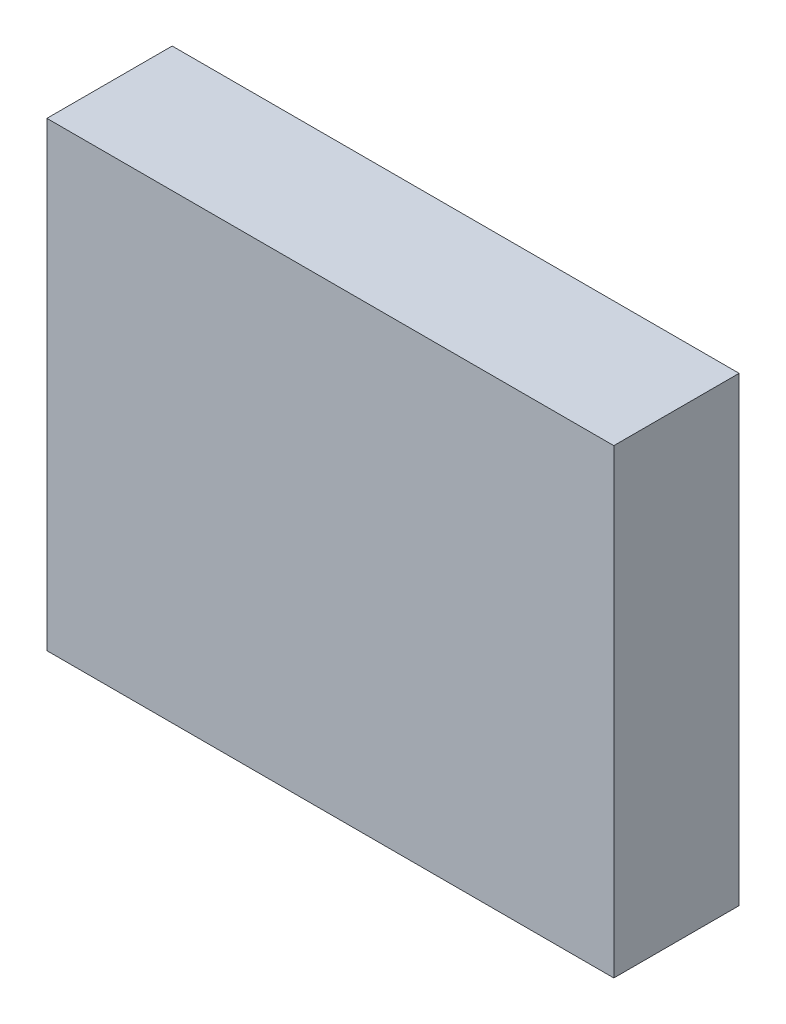
ISO-10303-21;
HEADER;
FILE_DESCRIPTION(('STEP AP214'),'2;1');
FILE_NAME('part.step','',(''),(''),'','','');
FILE_SCHEMA(('AUTOMOTIVE_DESIGN { 1 0 10303 214 1 1 1 1 }'));
ENDSEC;
DATA;
#1=APPLICATION_CONTEXT('core data for automotive mechanical design processes');
#2=APPLICATION_PROTOCOL_DEFINITION('international standard','automotive_design',2000,#1);
#3=PRODUCT_CONTEXT('',#1,'mechanical');
#4=PRODUCT('Part','Part','',(#3));
#5=PRODUCT_RELATED_PRODUCT_CATEGORY('part','',(#4));
#6=PRODUCT_DEFINITION_FORMATION('','',#4);
#7=PRODUCT_DEFINITION_CONTEXT('part definition',#1,'design');
#8=PRODUCT_DEFINITION('design','',#6,#7);
#9=PRODUCT_DEFINITION_SHAPE('','',#8);
#10=(LENGTH_UNIT() NAMED_UNIT(*) SI_UNIT(.MILLI.,.METRE.));
#11=(NAMED_UNIT(*) PLANE_ANGLE_UNIT() SI_UNIT($,.RADIAN.));
#12=(NAMED_UNIT(*) SI_UNIT($,.STERADIAN.) SOLID_ANGLE_UNIT());
#13=UNCERTAINTY_MEASURE_WITH_UNIT(LENGTH_MEASURE(1.E-05),#10,'distance_accuracy_value','');
#14=(GEOMETRIC_REPRESENTATION_CONTEXT(3) GLOBAL_UNCERTAINTY_ASSIGNED_CONTEXT((#13)) GLOBAL_UNIT_ASSIGNED_CONTEXT((#10,
#11,#12)) REPRESENTATION_CONTEXT('',''));
#15=CARTESIAN_POINT('',(0.,0.,0.));
#16=DIRECTION('',(0.,0.,1.));
#17=DIRECTION('',(1.,0.,0.));
#18=AXIS2_PLACEMENT_3D('',#15,#16,#17);
#19=CARTESIAN_POINT('',(1.0015,-0.184,0.));
#20=DIRECTION('',(1.,0.,0.));
#21=DIRECTION('',(0.,0.,1.));
#22=AXIS2_PLACEMENT_3D('',#19,#20,#21);
#23=PLANE('',#22);
#24=DIRECTION('',(0.,1.,0.));
#25=VECTOR('',#24,1.);
#26=CARTESIAN_POINT('',(1.0015,-0.184,0.1));
#27=LINE('',#26,#25);
#28=CARTESIAN_POINT('',(1.0015,-0.184,0.1));
#29=VERTEX_POINT('',#28);
#30=CARTESIAN_POINT('',(1.0015,0.184,0.1));
#31=VERTEX_POINT('',#30);
#32=EDGE_CURVE('E11',#29,#31,#27,.T.);
#33=ORIENTED_EDGE('',*,*,#32,.T.);
#34=DIRECTION('',(0.,0.,1.));
#35=VECTOR('',#34,1.);
#36=CARTESIAN_POINT('',(1.0015,0.184,0.));
#37=LINE('',#36,#35);
#38=CARTESIAN_POINT('',(1.0015,0.184,0.));
#39=VERTEX_POINT('',#38);
#40=EDGE_CURVE('E24',#39,#31,#37,.T.);
#41=ORIENTED_EDGE('',*,*,#40,.F.);
#42=DIRECTION('',(0.,1.,0.));
#43=VECTOR('',#42,1.);
#44=CARTESIAN_POINT('',(1.0015,-0.184,0.));
#45=LINE('',#44,#43);
#46=CARTESIAN_POINT('',(1.0015,-0.184,0.));
#47=VERTEX_POINT('',#46);
#48=EDGE_CURVE('E86',#47,#39,#45,.T.);
#49=ORIENTED_EDGE('',*,*,#48,.F.);
#50=DIRECTION('',(0.,0.,1.));
#51=VECTOR('',#50,1.);
#52=CARTESIAN_POINT('',(1.0015,-0.184,0.));
#53=LINE('',#52,#51);
#54=EDGE_CURVE('E36',#47,#29,#53,.T.);
#55=ORIENTED_EDGE('',*,*,#54,.T.);
#56=EDGE_LOOP('',(#33,#41,#49,#55));
#57=FACE_BOUND('',#56,.T.);
#58=ADVANCED_FACE('F17',(#57),#23,.F.);
#59=CARTESIAN_POINT('',(1.454,-0.184,0.));
#60=DIRECTION('',(1.,0.,0.));
#61=DIRECTION('',(0.,0.,1.));
#62=AXIS2_PLACEMENT_3D('',#59,#60,#61);
#63=PLANE('',#62);
#64=DIRECTION('',(0.,0.,1.));
#65=VECTOR('',#64,1.);
#66=CARTESIAN_POINT('',(1.454,-0.184,0.));
#67=LINE('',#66,#65);
#68=CARTESIAN_POINT('',(1.454,-0.184,0.));
#69=VERTEX_POINT('',#68);
#70=CARTESIAN_POINT('',(1.454,-0.184,0.1));
#71=VERTEX_POINT('',#70);
#72=EDGE_CURVE('E83',#69,#71,#67,.T.);
#73=ORIENTED_EDGE('',*,*,#72,.F.);
#74=DIRECTION('',(0.,1.,0.));
#75=VECTOR('',#74,1.);
#76=CARTESIAN_POINT('',(1.454,-0.184,0.));
#77=LINE('',#76,#75);
#78=CARTESIAN_POINT('',(1.454,0.184,0.));
#79=VERTEX_POINT('',#78);
#80=EDGE_CURVE('E63',#69,#79,#77,.T.);
#81=ORIENTED_EDGE('',*,*,#80,.T.);
#82=DIRECTION('',(0.,0.,1.));
#83=VECTOR('',#82,1.);
#84=CARTESIAN_POINT('',(1.454,0.184,0.));
#85=LINE('',#84,#83);
#86=CARTESIAN_POINT('',(1.454,0.184,0.1));
#87=VERTEX_POINT('',#86);
#88=EDGE_CURVE('E57',#79,#87,#85,.T.);
#89=ORIENTED_EDGE('',*,*,#88,.T.);
#90=DIRECTION('',(0.,1.,0.));
#91=VECTOR('',#90,1.);
#92=CARTESIAN_POINT('',(1.454,-0.184,0.1));
#93=LINE('',#92,#91);
#94=EDGE_CURVE('E60',#71,#87,#93,.T.);
#95=ORIENTED_EDGE('',*,*,#94,.F.);
#96=EDGE_LOOP('',(#73,#81,#89,#95));
#97=FACE_BOUND('',#96,.T.);
#98=ADVANCED_FACE('F59',(#97),#63,.T.);
#99=CARTESIAN_POINT('',(1.0015,-0.184,0.));
#100=DIRECTION('',(0.,1.,0.));
#101=DIRECTION('',(0.,0.,1.));
#102=AXIS2_PLACEMENT_3D('',#99,#100,#101);
#103=PLANE('',#102);
#104=ORIENTED_EDGE('',*,*,#72,.T.);
#105=DIRECTION('',(1.,0.,0.));
#106=VECTOR('',#105,1.);
#107=CARTESIAN_POINT('',(1.0015,-0.184,0.1));
#108=LINE('',#107,#106);
#109=EDGE_CURVE('E71',#29,#71,#108,.T.);
#110=ORIENTED_EDGE('',*,*,#109,.F.);
#111=ORIENTED_EDGE('',*,*,#54,.F.);
#112=DIRECTION('',(1.,0.,0.));
#113=VECTOR('',#112,1.);
#114=CARTESIAN_POINT('',(1.0015,-0.184,0.));
#115=LINE('',#114,#113);
#116=EDGE_CURVE('E76',#47,#69,#115,.T.);
#117=ORIENTED_EDGE('',*,*,#116,.T.);
#118=EDGE_LOOP('',(#104,#110,#111,#117));
#119=FACE_BOUND('',#118,.T.);
#120=ADVANCED_FACE('F91',(#119),#103,.F.);
#121=CARTESIAN_POINT('',(1.0015,0.184,0.));
#122=DIRECTION('',(0.,1.,0.));
#123=DIRECTION('',(0.,0.,1.));
#124=AXIS2_PLACEMENT_3D('',#121,#122,#123);
#125=PLANE('',#124);
#126=DIRECTION('',(1.,0.,0.));
#127=VECTOR('',#126,1.);
#128=CARTESIAN_POINT('',(1.0015,0.184,0.));
#129=LINE('',#128,#127);
#130=EDGE_CURVE('E74',#39,#79,#129,.T.);
#131=ORIENTED_EDGE('',*,*,#130,.F.);
#132=ORIENTED_EDGE('',*,*,#40,.T.);
#133=DIRECTION('',(1.,0.,0.));
#134=VECTOR('',#133,1.);
#135=CARTESIAN_POINT('',(1.0015,0.184,0.1));
#136=LINE('',#135,#134);
#137=EDGE_CURVE('E69',#31,#87,#136,.T.);
#138=ORIENTED_EDGE('',*,*,#137,.T.);
#139=ORIENTED_EDGE('',*,*,#88,.F.);
#140=EDGE_LOOP('',(#131,#132,#138,#139));
#141=FACE_BOUND('',#140,.T.);
#142=ADVANCED_FACE('F73',(#141),#125,.T.);
#143=CARTESIAN_POINT('',(1.0015,-0.184,0.));
#144=DIRECTION('',(0.,0.,1.));
#145=DIRECTION('',(1.,0.,0.));
#146=AXIS2_PLACEMENT_3D('',#143,#144,#145);
#147=PLANE('',#146);
#148=ORIENTED_EDGE('',*,*,#130,.T.);
#149=ORIENTED_EDGE('',*,*,#80,.F.);
#150=ORIENTED_EDGE('',*,*,#116,.F.);
#151=ORIENTED_EDGE('',*,*,#48,.T.);
#152=EDGE_LOOP('',(#148,#149,#150,#151));
#153=FACE_BOUND('',#152,.T.);
#154=ADVANCED_FACE('F89',(#153),#147,.F.);
#155=CARTESIAN_POINT('',(1.0015,-0.184,0.1));
#156=DIRECTION('',(0.,0.,1.));
#157=DIRECTION('',(1.,0.,0.));
#158=AXIS2_PLACEMENT_3D('',#155,#156,#157);
#159=PLANE('',#158);
#160=ORIENTED_EDGE('',*,*,#32,.F.);
#161=ORIENTED_EDGE('',*,*,#109,.T.);
#162=ORIENTED_EDGE('',*,*,#94,.T.);
#163=ORIENTED_EDGE('',*,*,#137,.F.);
#164=EDGE_LOOP('',(#160,#161,#162,#163));
#165=FACE_BOUND('',#164,.T.);
#166=ADVANCED_FACE('F68',(#165),#159,.T.);
#167=CLOSED_SHELL('',(#58,#98,#120,#142,#154,#166));
#168=MANIFOLD_SOLID_BREP('B1',#167);
#169=ADVANCED_BREP_SHAPE_REPRESENTATION('',(#18,#168),#14);
#170=SHAPE_DEFINITION_REPRESENTATION(#9,#169);
ENDSEC;
END-ISO-10303-21;
